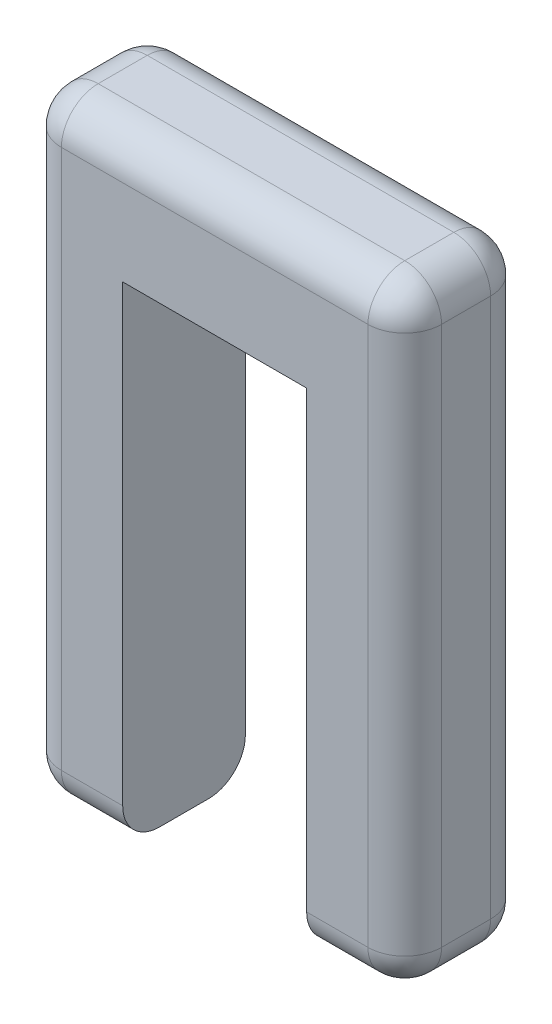
ISO-10303-21;
HEADER;
FILE_DESCRIPTION(('STEP AP214'),'2;1');
FILE_NAME('part.step','',(''),(''),'','','');
FILE_SCHEMA(('AUTOMOTIVE_DESIGN { 1 0 10303 214 1 1 1 1 }'));
ENDSEC;
DATA;
#1=APPLICATION_CONTEXT('core data for automotive mechanical design processes');
#2=APPLICATION_PROTOCOL_DEFINITION('international standard','automotive_design',2000,#1);
#3=PRODUCT_CONTEXT('',#1,'mechanical');
#4=PRODUCT('Part','Part','',(#3));
#5=PRODUCT_RELATED_PRODUCT_CATEGORY('part','',(#4));
#6=PRODUCT_DEFINITION_FORMATION('','',#4);
#7=PRODUCT_DEFINITION_CONTEXT('part definition',#1,'design');
#8=PRODUCT_DEFINITION('design','',#6,#7);
#9=PRODUCT_DEFINITION_SHAPE('','',#8);
#10=(LENGTH_UNIT() NAMED_UNIT(*) SI_UNIT(.MILLI.,.METRE.));
#11=(NAMED_UNIT(*) PLANE_ANGLE_UNIT() SI_UNIT($,.RADIAN.));
#12=(NAMED_UNIT(*) SI_UNIT($,.STERADIAN.) SOLID_ANGLE_UNIT());
#13=UNCERTAINTY_MEASURE_WITH_UNIT(LENGTH_MEASURE(1.E-05),#10,'distance_accuracy_value','');
#14=(GEOMETRIC_REPRESENTATION_CONTEXT(3) GLOBAL_UNCERTAINTY_ASSIGNED_CONTEXT((#13)) GLOBAL_UNIT_ASSIGNED_CONTEXT((#10,
#11,#12)) REPRESENTATION_CONTEXT('',''));
#15=CARTESIAN_POINT('',(0.,0.,0.));
#16=DIRECTION('',(0.,0.,1.));
#17=DIRECTION('',(1.,0.,0.));
#18=AXIS2_PLACEMENT_3D('',#15,#16,#17);
#19=CARTESIAN_POINT('',(-77.5,-200.,50.));
#20=DIRECTION('',(0.,1.,0.));
#21=DIRECTION('',(0.,0.,1.));
#22=AXIS2_PLACEMENT_3D('',#19,#20,#21);
#23=PLANE('',#22);
#24=DIRECTION('',(0.,0.,-1.));
#25=VECTOR('',#24,1.);
#26=CARTESIAN_POINT('',(-37.5,-200.,50.));
#27=LINE('',#26,#25);
#28=CARTESIAN_POINT('',(-37.5,-200.,35.));
#29=VERTEX_POINT('',#28);
#30=CARTESIAN_POINT('',(-37.5,-200.,15.));
#31=VERTEX_POINT('',#30);
#32=EDGE_CURVE('E180',#29,#31,#27,.T.);
#33=ORIENTED_EDGE('',*,*,#32,.F.);
#34=DIRECTION('',(1.,0.,0.));
#35=VECTOR('',#34,1.);
#36=CARTESIAN_POINT('',(-77.5,-200.,35.));
#37=LINE('',#36,#35);
#38=CARTESIAN_POINT('',(-62.5,-200.,35.));
#39=VERTEX_POINT('',#38);
#40=EDGE_CURVE('E251',#29,#39,#37,.F.);
#41=ORIENTED_EDGE('',*,*,#40,.T.);
#42=DIRECTION('',(0.,0.,-1.));
#43=VECTOR('',#42,1.);
#44=CARTESIAN_POINT('',(-62.5,-200.,50.));
#45=LINE('',#44,#43);
#46=CARTESIAN_POINT('',(-62.5,-200.,15.));
#47=VERTEX_POINT('',#46);
#48=EDGE_CURVE('E249',#39,#47,#45,.T.);
#49=ORIENTED_EDGE('',*,*,#48,.T.);
#50=DIRECTION('',(1.,0.,0.));
#51=VECTOR('',#50,1.);
#52=CARTESIAN_POINT('',(-77.5,-200.,15.));
#53=LINE('',#52,#51);
#54=EDGE_CURVE('E247',#47,#31,#53,.T.);
#55=ORIENTED_EDGE('',*,*,#54,.T.);
#56=EDGE_LOOP('',(#33,#41,#49,#55));
#57=FACE_BOUND('',#56,.T.);
#58=ADVANCED_FACE('F36',(#57),#23,.F.);
#59=CARTESIAN_POINT('',(-37.5,-200.,50.));
#60=DIRECTION('',(-1.,0.,0.));
#61=DIRECTION('',(0.,-1.,0.));
#62=AXIS2_PLACEMENT_3D('',#59,#60,#61);
#63=PLANE('',#62);
#64=DIRECTION('',(0.,1.,0.));
#65=VECTOR('',#64,1.);
#66=CARTESIAN_POINT('',(-37.5,-200.,50.));
#67=LINE('',#66,#65);
#68=CARTESIAN_POINT('',(-37.5,-185.,50.));
#69=VERTEX_POINT('',#68);
#70=CARTESIAN_POINT('',(-37.5,0.,50.));
#71=VERTEX_POINT('',#70);
#72=EDGE_CURVE('E160',#69,#71,#67,.T.);
#73=ORIENTED_EDGE('',*,*,#72,.F.);
#74=CARTESIAN_POINT('',(-37.5,-185.,35.));
#75=DIRECTION('',(-1.,0.,0.));
#76=DIRECTION('',(0.,-1.,0.));
#77=AXIS2_PLACEMENT_3D('',#74,#75,#76);
#78=CIRCLE('',#77,15.);
#79=EDGE_CURVE('E255',#69,#29,#78,.F.);
#80=ORIENTED_EDGE('',*,*,#79,.T.);
#81=ORIENTED_EDGE('',*,*,#32,.T.);
#82=CARTESIAN_POINT('',(-37.5,-185.,15.));
#83=DIRECTION('',(-1.,0.,0.));
#84=DIRECTION('',(0.,-1.,0.));
#85=AXIS2_PLACEMENT_3D('',#82,#83,#84);
#86=CIRCLE('',#85,15.);
#87=CARTESIAN_POINT('',(-37.5,-185.,0.));
#88=VERTEX_POINT('',#87);
#89=EDGE_CURVE('E253',#31,#88,#86,.F.);
#90=ORIENTED_EDGE('',*,*,#89,.T.);
#91=DIRECTION('',(0.,1.,0.));
#92=VECTOR('',#91,1.);
#93=CARTESIAN_POINT('',(-37.5,-200.,0.));
#94=LINE('',#93,#92);
#95=CARTESIAN_POINT('',(-37.5,0.,0.));
#96=VERTEX_POINT('',#95);
#97=EDGE_CURVE('E177',#88,#96,#94,.T.);
#98=ORIENTED_EDGE('',*,*,#97,.T.);
#99=DIRECTION('',(0.,0.,-1.));
#100=VECTOR('',#99,1.);
#101=CARTESIAN_POINT('',(-37.5,0.,50.));
#102=LINE('',#101,#100);
#103=EDGE_CURVE('E174',#71,#96,#102,.T.);
#104=ORIENTED_EDGE('',*,*,#103,.F.);
#105=EDGE_LOOP('',(#73,#80,#81,#90,#98,#104));
#106=FACE_BOUND('',#105,.T.);
#107=ADVANCED_FACE('F175',(#106),#63,.F.);
#108=CARTESIAN_POINT('',(-37.5,0.,50.));
#109=DIRECTION('',(0.,1.,0.));
#110=DIRECTION('',(0.,0.,1.));
#111=AXIS2_PLACEMENT_3D('',#108,#109,#110);
#112=PLANE('',#111);
#113=DIRECTION('',(1.,0.,0.));
#114=VECTOR('',#113,1.);
#115=CARTESIAN_POINT('',(-37.5,0.,0.));
#116=LINE('',#115,#114);
#117=CARTESIAN_POINT('',(37.5,0.,0.));
#118=VERTEX_POINT('',#117);
#119=EDGE_CURVE('E192',#96,#118,#116,.T.);
#120=ORIENTED_EDGE('',*,*,#119,.T.);
#121=DIRECTION('',(0.,0.,-1.));
#122=VECTOR('',#121,1.);
#123=CARTESIAN_POINT('',(37.5,0.,50.));
#124=LINE('',#123,#122);
#125=CARTESIAN_POINT('',(37.5,0.,50.));
#126=VERTEX_POINT('',#125);
#127=EDGE_CURVE('E181',#126,#118,#124,.T.);
#128=ORIENTED_EDGE('',*,*,#127,.F.);
#129=DIRECTION('',(1.,0.,0.));
#130=VECTOR('',#129,1.);
#131=CARTESIAN_POINT('',(-37.5,0.,50.));
#132=LINE('',#131,#130);
#133=EDGE_CURVE('E165',#71,#126,#132,.T.);
#134=ORIENTED_EDGE('',*,*,#133,.F.);
#135=ORIENTED_EDGE('',*,*,#103,.T.);
#136=EDGE_LOOP('',(#120,#128,#134,#135));
#137=FACE_BOUND('',#136,.T.);
#138=ADVANCED_FACE('F183',(#137),#112,.F.);
#139=CARTESIAN_POINT('',(37.5,0.,50.));
#140=DIRECTION('',(1.,0.,0.));
#141=DIRECTION('',(0.,1.,0.));
#142=AXIS2_PLACEMENT_3D('',#139,#140,#141);
#143=PLANE('',#142);
#144=DIRECTION('',(0.,-1.,0.));
#145=VECTOR('',#144,1.);
#146=CARTESIAN_POINT('',(37.5,0.,0.));
#147=LINE('',#146,#145);
#148=CARTESIAN_POINT('',(37.5,-185.,0.));
#149=VERTEX_POINT('',#148);
#150=EDGE_CURVE('E171',#118,#149,#147,.T.);
#151=ORIENTED_EDGE('',*,*,#150,.T.);
#152=CARTESIAN_POINT('',(37.5,-185.,15.));
#153=DIRECTION('',(1.,0.,0.));
#154=DIRECTION('',(0.,1.,0.));
#155=AXIS2_PLACEMENT_3D('',#152,#153,#154);
#156=CIRCLE('',#155,15.);
#157=CARTESIAN_POINT('',(37.5,-200.,15.));
#158=VERTEX_POINT('',#157);
#159=EDGE_CURVE('E11',#149,#158,#156,.F.);
#160=ORIENTED_EDGE('',*,*,#159,.T.);
#161=DIRECTION('',(0.,0.,-1.));
#162=VECTOR('',#161,1.);
#163=CARTESIAN_POINT('',(37.5,-200.,50.));
#164=LINE('',#163,#162);
#165=CARTESIAN_POINT('',(37.5,-200.,35.));
#166=VERTEX_POINT('',#165);
#167=EDGE_CURVE('E188',#166,#158,#164,.T.);
#168=ORIENTED_EDGE('',*,*,#167,.F.);
#169=CARTESIAN_POINT('',(37.5,-185.,35.));
#170=DIRECTION('',(1.,0.,0.));
#171=DIRECTION('',(0.,1.,0.));
#172=AXIS2_PLACEMENT_3D('',#169,#170,#171);
#173=CIRCLE('',#172,15.);
#174=CARTESIAN_POINT('',(37.5,-185.,50.));
#175=VERTEX_POINT('',#174);
#176=EDGE_CURVE('E45',#166,#175,#173,.F.);
#177=ORIENTED_EDGE('',*,*,#176,.T.);
#178=DIRECTION('',(0.,-1.,0.));
#179=VECTOR('',#178,1.);
#180=CARTESIAN_POINT('',(37.5,0.,50.));
#181=LINE('',#180,#179);
#182=EDGE_CURVE('E186',#126,#175,#181,.T.);
#183=ORIENTED_EDGE('',*,*,#182,.F.);
#184=ORIENTED_EDGE('',*,*,#127,.T.);
#185=EDGE_LOOP('',(#151,#160,#168,#177,#183,#184));
#186=FACE_BOUND('',#185,.T.);
#187=ADVANCED_FACE('F347',(#186),#143,.F.);
#188=CARTESIAN_POINT('',(37.5,-200.,50.));
#189=DIRECTION('',(0.,1.,0.));
#190=DIRECTION('',(0.,0.,1.));
#191=AXIS2_PLACEMENT_3D('',#188,#189,#190);
#192=PLANE('',#191);
#193=ORIENTED_EDGE('',*,*,#167,.T.);
#194=DIRECTION('',(1.,0.,0.));
#195=VECTOR('',#194,1.);
#196=CARTESIAN_POINT('',(37.5,-200.,15.));
#197=LINE('',#196,#195);
#198=CARTESIAN_POINT('',(62.5,-200.,15.));
#199=VERTEX_POINT('',#198);
#200=EDGE_CURVE('E58',#158,#199,#197,.T.);
#201=ORIENTED_EDGE('',*,*,#200,.T.);
#202=DIRECTION('',(0.,0.,-1.));
#203=VECTOR('',#202,1.);
#204=CARTESIAN_POINT('',(62.5,-200.,50.));
#205=LINE('',#204,#203);
#206=CARTESIAN_POINT('',(62.5,-200.,35.));
#207=VERTEX_POINT('',#206);
#208=EDGE_CURVE('E53',#199,#207,#205,.F.);
#209=ORIENTED_EDGE('',*,*,#208,.T.);
#210=DIRECTION('',(1.,0.,0.));
#211=VECTOR('',#210,1.);
#212=CARTESIAN_POINT('',(37.5,-200.,35.));
#213=LINE('',#212,#211);
#214=EDGE_CURVE('E258',#207,#166,#213,.F.);
#215=ORIENTED_EDGE('',*,*,#214,.T.);
#216=EDGE_LOOP('',(#193,#201,#209,#215));
#217=FACE_BOUND('',#216,.T.);
#218=ADVANCED_FACE('F345',(#217),#192,.F.);
#219=CARTESIAN_POINT('',(77.5,-200.,50.));
#220=DIRECTION('',(-1.,0.,0.));
#221=DIRECTION('',(0.,-1.,0.));
#222=AXIS2_PLACEMENT_3D('',#219,#220,#221);
#223=PLANE('',#222);
#224=DIRECTION('',(0.,1.,0.));
#225=VECTOR('',#224,1.);
#226=CARTESIAN_POINT('',(77.5,-200.,15.));
#227=LINE('',#226,#225);
#228=CARTESIAN_POINT('',(77.5,-185.,15.));
#229=VERTEX_POINT('',#228);
#230=CARTESIAN_POINT('',(77.5,35.,15.));
#231=VERTEX_POINT('',#230);
#232=EDGE_CURVE('E231',#229,#231,#227,.T.);
#233=ORIENTED_EDGE('',*,*,#232,.T.);
#234=DIRECTION('',(0.,0.,-1.));
#235=VECTOR('',#234,1.);
#236=CARTESIAN_POINT('',(77.5,35.,50.));
#237=LINE('',#236,#235);
#238=CARTESIAN_POINT('',(77.5,35.,35.));
#239=VERTEX_POINT('',#238);
#240=EDGE_CURVE('E235',#231,#239,#237,.F.);
#241=ORIENTED_EDGE('',*,*,#240,.T.);
#242=DIRECTION('',(0.,1.,0.));
#243=VECTOR('',#242,1.);
#244=CARTESIAN_POINT('',(77.5,-200.,35.));
#245=LINE('',#244,#243);
#246=CARTESIAN_POINT('',(77.5,-185.,35.));
#247=VERTEX_POINT('',#246);
#248=EDGE_CURVE('E233',#239,#247,#245,.F.);
#249=ORIENTED_EDGE('',*,*,#248,.T.);
#250=DIRECTION('',(0.,0.,-1.));
#251=VECTOR('',#250,1.);
#252=CARTESIAN_POINT('',(77.5,-185.,50.));
#253=LINE('',#252,#251);
#254=EDGE_CURVE('E229',#247,#229,#253,.T.);
#255=ORIENTED_EDGE('',*,*,#254,.T.);
#256=EDGE_LOOP('',(#233,#241,#249,#255));
#257=FACE_BOUND('',#256,.T.);
#258=ADVANCED_FACE('F361',(#257),#223,.F.);
#259=CARTESIAN_POINT('',(77.5,50.,50.));
#260=DIRECTION('',(0.,-1.,0.));
#261=DIRECTION('',(0.,0.,-1.));
#262=AXIS2_PLACEMENT_3D('',#259,#260,#261);
#263=PLANE('',#262);
#264=DIRECTION('',(-1.,0.,0.));
#265=VECTOR('',#264,1.);
#266=CARTESIAN_POINT('',(77.5,50.,15.));
#267=LINE('',#266,#265);
#268=CARTESIAN_POINT('',(62.5,50.,15.));
#269=VERTEX_POINT('',#268);
#270=CARTESIAN_POINT('',(-62.5,50.,15.));
#271=VERTEX_POINT('',#270);
#272=EDGE_CURVE('E213',#269,#271,#267,.T.);
#273=ORIENTED_EDGE('',*,*,#272,.T.);
#274=DIRECTION('',(0.,0.,-1.));
#275=VECTOR('',#274,1.);
#276=CARTESIAN_POINT('',(-62.5,50.,50.));
#277=LINE('',#276,#275);
#278=CARTESIAN_POINT('',(-62.5,50.,35.));
#279=VERTEX_POINT('',#278);
#280=EDGE_CURVE('E215',#271,#279,#277,.F.);
#281=ORIENTED_EDGE('',*,*,#280,.T.);
#282=DIRECTION('',(-1.,0.,0.));
#283=VECTOR('',#282,1.);
#284=CARTESIAN_POINT('',(77.5,50.,35.));
#285=LINE('',#284,#283);
#286=CARTESIAN_POINT('',(62.5,50.,35.));
#287=VERTEX_POINT('',#286);
#288=EDGE_CURVE('E209',#279,#287,#285,.F.);
#289=ORIENTED_EDGE('',*,*,#288,.T.);
#290=DIRECTION('',(0.,0.,-1.));
#291=VECTOR('',#290,1.);
#292=CARTESIAN_POINT('',(62.5,50.,50.));
#293=LINE('',#292,#291);
#294=EDGE_CURVE('E211',#287,#269,#293,.T.);
#295=ORIENTED_EDGE('',*,*,#294,.T.);
#296=EDGE_LOOP('',(#273,#281,#289,#295));
#297=FACE_BOUND('',#296,.T.);
#298=ADVANCED_FACE('F382',(#297),#263,.F.);
#299=CARTESIAN_POINT('',(-77.5,50.,50.));
#300=DIRECTION('',(1.,0.,0.));
#301=DIRECTION('',(0.,1.,0.));
#302=AXIS2_PLACEMENT_3D('',#299,#300,#301);
#303=PLANE('',#302);
#304=DIRECTION('',(0.,-1.,0.));
#305=VECTOR('',#304,1.);
#306=CARTESIAN_POINT('',(-77.5,50.,35.));
#307=LINE('',#306,#305);
#308=CARTESIAN_POINT('',(-77.5,-185.,35.));
#309=VERTEX_POINT('',#308);
#310=CARTESIAN_POINT('',(-77.5,35.,35.));
#311=VERTEX_POINT('',#310);
#312=EDGE_CURVE('E204',#309,#311,#307,.F.);
#313=ORIENTED_EDGE('',*,*,#312,.T.);
#314=DIRECTION('',(0.,0.,-1.));
#315=VECTOR('',#314,1.);
#316=CARTESIAN_POINT('',(-77.5,35.,50.));
#317=LINE('',#316,#315);
#318=CARTESIAN_POINT('',(-77.5,35.,15.));
#319=VERTEX_POINT('',#318);
#320=EDGE_CURVE('E206',#311,#319,#317,.T.);
#321=ORIENTED_EDGE('',*,*,#320,.T.);
#322=DIRECTION('',(0.,-1.,0.));
#323=VECTOR('',#322,1.);
#324=CARTESIAN_POINT('',(-77.5,50.,15.));
#325=LINE('',#324,#323);
#326=CARTESIAN_POINT('',(-77.5,-185.,15.));
#327=VERTEX_POINT('',#326);
#328=EDGE_CURVE('E202',#319,#327,#325,.T.);
#329=ORIENTED_EDGE('',*,*,#328,.T.);
#330=DIRECTION('',(0.,0.,-1.));
#331=VECTOR('',#330,1.);
#332=CARTESIAN_POINT('',(-77.5,-185.,50.));
#333=LINE('',#332,#331);
#334=EDGE_CURVE('E200',#327,#309,#333,.F.);
#335=ORIENTED_EDGE('',*,*,#334,.T.);
#336=EDGE_LOOP('',(#313,#321,#329,#335));
#337=FACE_BOUND('',#336,.T.);
#338=ADVANCED_FACE('F432',(#337),#303,.F.);
#339=CARTESIAN_POINT('',(0.,0.,50.));
#340=DIRECTION('',(0.,0.,1.));
#341=DIRECTION('',(1.,0.,0.));
#342=AXIS2_PLACEMENT_3D('',#339,#340,#341);
#343=PLANE('',#342);
#344=DIRECTION('',(0.,-1.,0.));
#345=VECTOR('',#344,1.);
#346=CARTESIAN_POINT('',(-62.5,-200.,50.));
#347=LINE('',#346,#345);
#348=CARTESIAN_POINT('',(-62.5,35.,50.));
#349=VERTEX_POINT('',#348);
#350=CARTESIAN_POINT('',(-62.5,-185.,50.));
#351=VERTEX_POINT('',#350);
#352=EDGE_CURVE('E244',#349,#351,#347,.T.);
#353=ORIENTED_EDGE('',*,*,#352,.T.);
#354=DIRECTION('',(1.,0.,0.));
#355=VECTOR('',#354,1.);
#356=CARTESIAN_POINT('',(-37.5,-185.,50.));
#357=LINE('',#356,#355);
#358=EDGE_CURVE('E168',#351,#69,#357,.T.);
#359=ORIENTED_EDGE('',*,*,#358,.T.);
#360=ORIENTED_EDGE('',*,*,#72,.T.);
#361=ORIENTED_EDGE('',*,*,#133,.T.);
#362=ORIENTED_EDGE('',*,*,#182,.T.);
#363=DIRECTION('',(1.,0.,0.));
#364=VECTOR('',#363,1.);
#365=CARTESIAN_POINT('',(77.5,-185.,50.));
#366=LINE('',#365,#364);
#367=CARTESIAN_POINT('',(62.5,-185.,50.));
#368=VERTEX_POINT('',#367);
#369=EDGE_CURVE('E238',#175,#368,#366,.T.);
#370=ORIENTED_EDGE('',*,*,#369,.T.);
#371=DIRECTION('',(0.,1.,0.));
#372=VECTOR('',#371,1.);
#373=CARTESIAN_POINT('',(62.5,50.,50.));
#374=LINE('',#373,#372);
#375=CARTESIAN_POINT('',(62.5,35.,50.));
#376=VERTEX_POINT('',#375);
#377=EDGE_CURVE('E240',#368,#376,#374,.T.);
#378=ORIENTED_EDGE('',*,*,#377,.T.);
#379=DIRECTION('',(-1.,0.,0.));
#380=VECTOR('',#379,1.);
#381=CARTESIAN_POINT('',(-77.5,35.,50.));
#382=LINE('',#381,#380);
#383=EDGE_CURVE('E242',#376,#349,#382,.T.);
#384=ORIENTED_EDGE('',*,*,#383,.T.);
#385=EDGE_LOOP('',(#353,#359,#360,#361,#362,#370,#378,#384));
#386=FACE_BOUND('',#385,.T.);
#387=ADVANCED_FACE('F162',(#386),#343,.T.);
#388=CARTESIAN_POINT('',(0.,0.,0.));
#389=DIRECTION('',(0.,0.,1.));
#390=DIRECTION('',(1.,0.,0.));
#391=AXIS2_PLACEMENT_3D('',#388,#389,#390);
#392=PLANE('',#391);
#393=ORIENTED_EDGE('',*,*,#97,.F.);
#394=DIRECTION('',(1.,0.,0.));
#395=VECTOR('',#394,1.);
#396=CARTESIAN_POINT('',(0.,-185.,0.));
#397=LINE('',#396,#395);
#398=CARTESIAN_POINT('',(-62.5,-185.,0.));
#399=VERTEX_POINT('',#398);
#400=EDGE_CURVE('E227',#88,#399,#397,.F.);
#401=ORIENTED_EDGE('',*,*,#400,.T.);
#402=DIRECTION('',(0.,-1.,0.));
#403=VECTOR('',#402,1.);
#404=CARTESIAN_POINT('',(-62.5,0.,0.));
#405=LINE('',#404,#403);
#406=CARTESIAN_POINT('',(-62.5,35.,0.));
#407=VERTEX_POINT('',#406);
#408=EDGE_CURVE('E225',#399,#407,#405,.F.);
#409=ORIENTED_EDGE('',*,*,#408,.T.);
#410=DIRECTION('',(-1.,0.,0.));
#411=VECTOR('',#410,1.);
#412=CARTESIAN_POINT('',(0.,35.,0.));
#413=LINE('',#412,#411);
#414=CARTESIAN_POINT('',(62.5,35.,0.));
#415=VERTEX_POINT('',#414);
#416=EDGE_CURVE('E222',#407,#415,#413,.F.);
#417=ORIENTED_EDGE('',*,*,#416,.T.);
#418=DIRECTION('',(0.,1.,0.));
#419=VECTOR('',#418,1.);
#420=CARTESIAN_POINT('',(62.5,0.,0.));
#421=LINE('',#420,#419);
#422=CARTESIAN_POINT('',(62.5,-185.,0.));
#423=VERTEX_POINT('',#422);
#424=EDGE_CURVE('E220',#415,#423,#421,.F.);
#425=ORIENTED_EDGE('',*,*,#424,.T.);
#426=DIRECTION('',(1.,0.,0.));
#427=VECTOR('',#426,1.);
#428=CARTESIAN_POINT('',(0.,-185.,0.));
#429=LINE('',#428,#427);
#430=EDGE_CURVE('E218',#423,#149,#429,.F.);
#431=ORIENTED_EDGE('',*,*,#430,.T.);
#432=ORIENTED_EDGE('',*,*,#150,.F.);
#433=ORIENTED_EDGE('',*,*,#119,.F.);
#434=EDGE_LOOP('',(#393,#401,#409,#417,#425,#431,#432,#433));
#435=FACE_BOUND('',#434,.T.);
#436=ADVANCED_FACE('F420',(#435),#392,.F.);
#437=CARTESIAN_POINT('',(0.,-185.,35.));
#438=DIRECTION('',(-1.,0.,0.));
#439=DIRECTION('',(0.,0.,1.));
#440=AXIS2_PLACEMENT_3D('',#437,#438,#439);
#441=CYLINDRICAL_SURFACE('',#440,15.);
#442=ORIENTED_EDGE('',*,*,#176,.F.);
#443=ORIENTED_EDGE('',*,*,#214,.F.);
#444=CARTESIAN_POINT('',(62.5,-185.,35.));
#445=DIRECTION('',(1.,0.,0.));
#446=DIRECTION('',(0.,0.,-1.));
#447=AXIS2_PLACEMENT_3D('',#444,#445,#446);
#448=CIRCLE('',#447,15.);
#449=EDGE_CURVE('E323',#368,#207,#448,.T.);
#450=ORIENTED_EDGE('',*,*,#449,.F.);
#451=ORIENTED_EDGE('',*,*,#369,.F.);
#452=EDGE_LOOP('',(#442,#443,#450,#451));
#453=FACE_BOUND('',#452,.T.);
#454=ADVANCED_FACE('F38',(#453),#441,.T.);
#455=CARTESIAN_POINT('',(37.5,-185.,15.));
#456=DIRECTION('',(1.,0.,0.));
#457=DIRECTION('',(0.,0.,-1.));
#458=AXIS2_PLACEMENT_3D('',#455,#456,#457);
#459=CYLINDRICAL_SURFACE('',#458,15.);
#460=ORIENTED_EDGE('',*,*,#159,.F.);
#461=ORIENTED_EDGE('',*,*,#430,.F.);
#462=CARTESIAN_POINT('',(62.5,-185.,15.));
#463=DIRECTION('',(1.,0.,0.));
#464=DIRECTION('',(0.,0.,-1.));
#465=AXIS2_PLACEMENT_3D('',#462,#463,#464);
#466=CIRCLE('',#465,15.);
#467=EDGE_CURVE('E321',#199,#423,#466,.T.);
#468=ORIENTED_EDGE('',*,*,#467,.F.);
#469=ORIENTED_EDGE('',*,*,#200,.F.);
#470=EDGE_LOOP('',(#460,#461,#468,#469));
#471=FACE_BOUND('',#470,.T.);
#472=ADVANCED_FACE('F352',(#471),#459,.T.);
#473=CARTESIAN_POINT('',(62.5,-185.,50.));
#474=DIRECTION('',(0.,0.,-1.));
#475=DIRECTION('',(-1.,0.,0.));
#476=AXIS2_PLACEMENT_3D('',#473,#474,#475);
#477=CYLINDRICAL_SURFACE('',#476,15.);
#478=CARTESIAN_POINT('',(62.5,-185.,35.));
#479=DIRECTION('',(0.,0.,1.));
#480=DIRECTION('',(1.,0.,0.));
#481=AXIS2_PLACEMENT_3D('',#478,#479,#480);
#482=CIRCLE('',#481,15.);
#483=EDGE_CURVE('E40',#207,#247,#482,.T.);
#484=ORIENTED_EDGE('',*,*,#483,.F.);
#485=ORIENTED_EDGE('',*,*,#208,.F.);
#486=CARTESIAN_POINT('',(62.5,-185.,15.));
#487=DIRECTION('',(0.,0.,-1.));
#488=DIRECTION('',(-1.,0.,0.));
#489=AXIS2_PLACEMENT_3D('',#486,#487,#488);
#490=CIRCLE('',#489,15.);
#491=EDGE_CURVE('E318',#229,#199,#490,.T.);
#492=ORIENTED_EDGE('',*,*,#491,.F.);
#493=ORIENTED_EDGE('',*,*,#254,.F.);
#494=EDGE_LOOP('',(#484,#485,#492,#493));
#495=FACE_BOUND('',#494,.T.);
#496=ADVANCED_FACE('F359',(#495),#477,.T.);
#497=CARTESIAN_POINT('',(62.5,-185.,35.));
#498=DIRECTION('',(0.,-1.,0.));
#499=DIRECTION('',(0.,0.,-1.));
#500=AXIS2_PLACEMENT_3D('',#497,#498,#499);
#501=SPHERICAL_SURFACE('',#500,15.);
#502=ORIENTED_EDGE('',*,*,#449,.T.);
#503=ORIENTED_EDGE('',*,*,#483,.T.);
#504=CARTESIAN_POINT('',(62.5,-185.,35.));
#505=DIRECTION('',(0.,-1.,0.));
#506=DIRECTION('',(0.,0.,-1.));
#507=AXIS2_PLACEMENT_3D('',#504,#505,#506);
#508=CIRCLE('',#507,15.);
#509=EDGE_CURVE('E315',#368,#247,#508,.F.);
#510=ORIENTED_EDGE('',*,*,#509,.F.);
#511=EDGE_LOOP('',(#502,#503,#510));
#512=FACE_BOUND('',#511,.T.);
#513=ADVANCED_FACE('F330',(#512),#501,.T.);
#514=CARTESIAN_POINT('',(62.5,-185.,15.));
#515=DIRECTION('',(0.,-1.,0.));
#516=DIRECTION('',(0.,0.,-1.));
#517=AXIS2_PLACEMENT_3D('',#514,#515,#516);
#518=SPHERICAL_SURFACE('',#517,15.);
#519=ORIENTED_EDGE('',*,*,#491,.T.);
#520=ORIENTED_EDGE('',*,*,#467,.T.);
#521=CARTESIAN_POINT('',(62.5,-185.,15.));
#522=DIRECTION('',(0.,-1.,0.));
#523=DIRECTION('',(0.,0.,-1.));
#524=AXIS2_PLACEMENT_3D('',#521,#522,#523);
#525=CIRCLE('',#524,15.);
#526=EDGE_CURVE('E312',#229,#423,#525,.F.);
#527=ORIENTED_EDGE('',*,*,#526,.F.);
#528=EDGE_LOOP('',(#519,#520,#527));
#529=FACE_BOUND('',#528,.T.);
#530=ADVANCED_FACE('F357',(#529),#518,.T.);
#531=CARTESIAN_POINT('',(62.5,0.,35.));
#532=DIRECTION('',(0.,-1.,0.));
#533=DIRECTION('',(1.,0.,0.));
#534=AXIS2_PLACEMENT_3D('',#531,#532,#533);
#535=CYLINDRICAL_SURFACE('',#534,15.);
#536=ORIENTED_EDGE('',*,*,#509,.T.);
#537=ORIENTED_EDGE('',*,*,#248,.F.);
#538=CARTESIAN_POINT('',(62.5,35.,35.));
#539=DIRECTION('',(0.,1.,0.));
#540=DIRECTION('',(0.,0.,1.));
#541=AXIS2_PLACEMENT_3D('',#538,#539,#540);
#542=CIRCLE('',#541,15.);
#543=EDGE_CURVE('E307',#376,#239,#542,.T.);
#544=ORIENTED_EDGE('',*,*,#543,.F.);
#545=ORIENTED_EDGE('',*,*,#377,.F.);
#546=EDGE_LOOP('',(#536,#537,#544,#545));
#547=FACE_BOUND('',#546,.T.);
#548=ADVANCED_FACE('F336',(#547),#535,.T.);
#549=CARTESIAN_POINT('',(0.,-185.,35.));
#550=DIRECTION('',(-1.,0.,0.));
#551=DIRECTION('',(0.,0.,1.));
#552=AXIS2_PLACEMENT_3D('',#549,#550,#551);
#553=CYLINDRICAL_SURFACE('',#552,15.);
#554=ORIENTED_EDGE('',*,*,#79,.F.);
#555=ORIENTED_EDGE('',*,*,#358,.F.);
#556=CARTESIAN_POINT('',(-62.5,-185.,35.));
#557=DIRECTION('',(-1.,0.,0.));
#558=DIRECTION('',(0.,0.,1.));
#559=AXIS2_PLACEMENT_3D('',#556,#557,#558);
#560=CIRCLE('',#559,15.);
#561=EDGE_CURVE('E304',#39,#351,#560,.T.);
#562=ORIENTED_EDGE('',*,*,#561,.F.);
#563=ORIENTED_EDGE('',*,*,#40,.F.);
#564=EDGE_LOOP('',(#554,#555,#562,#563));
#565=FACE_BOUND('',#564,.T.);
#566=ADVANCED_FACE('F400',(#565),#553,.T.);
#567=CARTESIAN_POINT('',(-62.5,-185.,50.));
#568=DIRECTION('',(0.,0.,-1.));
#569=DIRECTION('',(-1.,0.,0.));
#570=AXIS2_PLACEMENT_3D('',#567,#568,#569);
#571=CYLINDRICAL_SURFACE('',#570,15.);
#572=CARTESIAN_POINT('',(-62.5,-185.,15.));
#573=DIRECTION('',(0.,0.,-1.));
#574=DIRECTION('',(-1.,0.,0.));
#575=AXIS2_PLACEMENT_3D('',#572,#573,#574);
#576=CIRCLE('',#575,15.);
#577=EDGE_CURVE('E298',#47,#327,#576,.T.);
#578=ORIENTED_EDGE('',*,*,#577,.F.);
#579=ORIENTED_EDGE('',*,*,#48,.F.);
#580=CARTESIAN_POINT('',(-62.5,-185.,35.));
#581=DIRECTION('',(0.,0.,1.));
#582=DIRECTION('',(1.,0.,0.));
#583=AXIS2_PLACEMENT_3D('',#580,#581,#582);
#584=CIRCLE('',#583,15.);
#585=EDGE_CURVE('E301',#309,#39,#584,.T.);
#586=ORIENTED_EDGE('',*,*,#585,.F.);
#587=ORIENTED_EDGE('',*,*,#334,.F.);
#588=EDGE_LOOP('',(#578,#579,#586,#587));
#589=FACE_BOUND('',#588,.T.);
#590=ADVANCED_FACE('F409',(#589),#571,.T.);
#591=CARTESIAN_POINT('',(-77.5,-185.,15.));
#592=DIRECTION('',(1.,0.,0.));
#593=DIRECTION('',(0.,0.,-1.));
#594=AXIS2_PLACEMENT_3D('',#591,#592,#593);
#595=CYLINDRICAL_SURFACE('',#594,15.);
#596=ORIENTED_EDGE('',*,*,#89,.F.);
#597=ORIENTED_EDGE('',*,*,#54,.F.);
#598=CARTESIAN_POINT('',(-62.5,-185.,15.));
#599=DIRECTION('',(-1.,0.,0.));
#600=DIRECTION('',(0.,0.,1.));
#601=AXIS2_PLACEMENT_3D('',#598,#599,#600);
#602=CIRCLE('',#601,15.);
#603=EDGE_CURVE('E295',#399,#47,#602,.T.);
#604=ORIENTED_EDGE('',*,*,#603,.F.);
#605=ORIENTED_EDGE('',*,*,#400,.F.);
#606=EDGE_LOOP('',(#596,#597,#604,#605));
#607=FACE_BOUND('',#606,.T.);
#608=ADVANCED_FACE('F416',(#607),#595,.T.);
#609=CARTESIAN_POINT('',(62.5,-200.,15.));
#610=DIRECTION('',(0.,1.,0.));
#611=DIRECTION('',(-1.,0.,0.));
#612=AXIS2_PLACEMENT_3D('',#609,#610,#611);
#613=CYLINDRICAL_SURFACE('',#612,15.);
#614=ORIENTED_EDGE('',*,*,#526,.T.);
#615=ORIENTED_EDGE('',*,*,#424,.F.);
#616=CARTESIAN_POINT('',(62.5,35.,15.));
#617=DIRECTION('',(0.,1.,0.));
#618=DIRECTION('',(0.,0.,1.));
#619=AXIS2_PLACEMENT_3D('',#616,#617,#618);
#620=CIRCLE('',#619,15.);
#621=EDGE_CURVE('E292',#231,#415,#620,.T.);
#622=ORIENTED_EDGE('',*,*,#621,.F.);
#623=ORIENTED_EDGE('',*,*,#232,.F.);
#624=EDGE_LOOP('',(#614,#615,#622,#623));
#625=FACE_BOUND('',#624,.T.);
#626=ADVANCED_FACE('F372',(#625),#613,.T.);
#627=CARTESIAN_POINT('',(62.5,35.,50.));
#628=DIRECTION('',(0.,0.,-1.));
#629=DIRECTION('',(-1.,0.,0.));
#630=AXIS2_PLACEMENT_3D('',#627,#628,#629);
#631=CYLINDRICAL_SURFACE('',#630,15.);
#632=CARTESIAN_POINT('',(62.5,35.,35.));
#633=DIRECTION('',(0.,0.,1.));
#634=DIRECTION('',(1.,0.,0.));
#635=AXIS2_PLACEMENT_3D('',#632,#633,#634);
#636=CIRCLE('',#635,15.);
#637=EDGE_CURVE('E309',#239,#287,#636,.T.);
#638=ORIENTED_EDGE('',*,*,#637,.F.);
#639=ORIENTED_EDGE('',*,*,#240,.F.);
#640=CARTESIAN_POINT('',(62.5,35.,15.));
#641=DIRECTION('',(0.,0.,-1.));
#642=DIRECTION('',(-1.,0.,0.));
#643=AXIS2_PLACEMENT_3D('',#640,#641,#642);
#644=CIRCLE('',#643,15.);
#645=EDGE_CURVE('E289',#269,#231,#644,.T.);
#646=ORIENTED_EDGE('',*,*,#645,.F.);
#647=ORIENTED_EDGE('',*,*,#294,.F.);
#648=EDGE_LOOP('',(#638,#639,#646,#647));
#649=FACE_BOUND('',#648,.T.);
#650=ADVANCED_FACE('F367',(#649),#631,.T.);
#651=CARTESIAN_POINT('',(62.5,35.,35.));
#652=DIRECTION('',(1.,0.,0.));
#653=DIRECTION('',(0.,0.,-1.));
#654=AXIS2_PLACEMENT_3D('',#651,#652,#653);
#655=SPHERICAL_SURFACE('',#654,15.);
#656=ORIENTED_EDGE('',*,*,#543,.T.);
#657=ORIENTED_EDGE('',*,*,#637,.T.);
#658=CARTESIAN_POINT('',(62.5,35.,35.));
#659=DIRECTION('',(1.,0.,0.));
#660=DIRECTION('',(0.,0.,-1.));
#661=AXIS2_PLACEMENT_3D('',#658,#659,#660);
#662=CIRCLE('',#661,15.);
#663=EDGE_CURVE('E286',#376,#287,#662,.F.);
#664=ORIENTED_EDGE('',*,*,#663,.F.);
#665=EDGE_LOOP('',(#656,#657,#664));
#666=FACE_BOUND('',#665,.T.);
#667=ADVANCED_FACE('F385',(#666),#655,.T.);
#668=CARTESIAN_POINT('',(-62.5,-185.,35.));
#669=DIRECTION('',(0.,-1.,0.));
#670=DIRECTION('',(0.,0.,-1.));
#671=AXIS2_PLACEMENT_3D('',#668,#669,#670);
#672=SPHERICAL_SURFACE('',#671,15.);
#673=ORIENTED_EDGE('',*,*,#585,.T.);
#674=ORIENTED_EDGE('',*,*,#561,.T.);
#675=CARTESIAN_POINT('',(-62.5,-185.,35.));
#676=DIRECTION('',(0.,-1.,0.));
#677=DIRECTION('',(0.,0.,-1.));
#678=AXIS2_PLACEMENT_3D('',#675,#676,#677);
#679=CIRCLE('',#678,15.);
#680=EDGE_CURVE('E283',#309,#351,#679,.F.);
#681=ORIENTED_EDGE('',*,*,#680,.F.);
#682=EDGE_LOOP('',(#673,#674,#681));
#683=FACE_BOUND('',#682,.T.);
#684=ADVANCED_FACE('F403',(#683),#672,.T.);
#685=CARTESIAN_POINT('',(-62.5,-185.,15.));
#686=DIRECTION('',(0.,-1.,0.));
#687=DIRECTION('',(0.,0.,-1.));
#688=AXIS2_PLACEMENT_3D('',#685,#686,#687);
#689=SPHERICAL_SURFACE('',#688,15.);
#690=ORIENTED_EDGE('',*,*,#603,.T.);
#691=ORIENTED_EDGE('',*,*,#577,.T.);
#692=CARTESIAN_POINT('',(-62.5,-185.,15.));
#693=DIRECTION('',(0.,-1.,0.));
#694=DIRECTION('',(0.,0.,-1.));
#695=AXIS2_PLACEMENT_3D('',#692,#693,#694);
#696=CIRCLE('',#695,15.);
#697=EDGE_CURVE('E280',#399,#327,#696,.F.);
#698=ORIENTED_EDGE('',*,*,#697,.F.);
#699=EDGE_LOOP('',(#690,#691,#698));
#700=FACE_BOUND('',#699,.T.);
#701=ADVANCED_FACE('F466',(#700),#689,.T.);
#702=CARTESIAN_POINT('',(62.5,35.,15.));
#703=DIRECTION('',(1.,0.,0.));
#704=DIRECTION('',(0.,0.,-1.));
#705=AXIS2_PLACEMENT_3D('',#702,#703,#704);
#706=SPHERICAL_SURFACE('',#705,15.);
#707=ORIENTED_EDGE('',*,*,#645,.T.);
#708=ORIENTED_EDGE('',*,*,#621,.T.);
#709=CARTESIAN_POINT('',(62.5,35.,15.));
#710=DIRECTION('',(1.,0.,0.));
#711=DIRECTION('',(0.,0.,-1.));
#712=AXIS2_PLACEMENT_3D('',#709,#710,#711);
#713=CIRCLE('',#712,15.);
#714=EDGE_CURVE('E278',#269,#415,#713,.F.);
#715=ORIENTED_EDGE('',*,*,#714,.F.);
#716=EDGE_LOOP('',(#707,#708,#715));
#717=FACE_BOUND('',#716,.T.);
#718=ADVANCED_FACE('F374',(#717),#706,.T.);
#719=CARTESIAN_POINT('',(0.,35.,35.));
#720=DIRECTION('',(1.,0.,0.));
#721=DIRECTION('',(0.,0.,-1.));
#722=AXIS2_PLACEMENT_3D('',#719,#720,#721);
#723=CYLINDRICAL_SURFACE('',#722,15.);
#724=ORIENTED_EDGE('',*,*,#663,.T.);
#725=ORIENTED_EDGE('',*,*,#288,.F.);
#726=CARTESIAN_POINT('',(-62.5,35.,35.));
#727=DIRECTION('',(-1.,0.,0.));
#728=DIRECTION('',(0.,0.,1.));
#729=AXIS2_PLACEMENT_3D('',#726,#727,#728);
#730=CIRCLE('',#729,15.);
#731=EDGE_CURVE('E275',#349,#279,#730,.T.);
#732=ORIENTED_EDGE('',*,*,#731,.F.);
#733=ORIENTED_EDGE('',*,*,#383,.F.);
#734=EDGE_LOOP('',(#724,#725,#732,#733));
#735=FACE_BOUND('',#734,.T.);
#736=ADVANCED_FACE('F387',(#735),#723,.T.);
#737=CARTESIAN_POINT('',(-62.5,0.,35.));
#738=DIRECTION('',(0.,1.,0.));
#739=DIRECTION('',(-1.,0.,0.));
#740=AXIS2_PLACEMENT_3D('',#737,#738,#739);
#741=CYLINDRICAL_SURFACE('',#740,15.);
#742=ORIENTED_EDGE('',*,*,#680,.T.);
#743=ORIENTED_EDGE('',*,*,#352,.F.);
#744=CARTESIAN_POINT('',(-62.5,35.,35.));
#745=DIRECTION('',(0.,1.,0.));
#746=DIRECTION('',(0.,0.,1.));
#747=AXIS2_PLACEMENT_3D('',#744,#745,#746);
#748=CIRCLE('',#747,15.);
#749=EDGE_CURVE('E272',#311,#349,#748,.T.);
#750=ORIENTED_EDGE('',*,*,#749,.F.);
#751=ORIENTED_EDGE('',*,*,#312,.F.);
#752=EDGE_LOOP('',(#742,#743,#750,#751));
#753=FACE_BOUND('',#752,.T.);
#754=ADVANCED_FACE('F396',(#753),#741,.T.);
#755=CARTESIAN_POINT('',(-62.5,50.,15.));
#756=DIRECTION('',(0.,-1.,0.));
#757=DIRECTION('',(1.,0.,0.));
#758=AXIS2_PLACEMENT_3D('',#755,#756,#757);
#759=CYLINDRICAL_SURFACE('',#758,15.);
#760=ORIENTED_EDGE('',*,*,#697,.T.);
#761=ORIENTED_EDGE('',*,*,#328,.F.);
#762=CARTESIAN_POINT('',(-62.5,35.,15.));
#763=DIRECTION('',(0.,1.,0.));
#764=DIRECTION('',(0.,0.,1.));
#765=AXIS2_PLACEMENT_3D('',#762,#763,#764);
#766=CIRCLE('',#765,15.);
#767=EDGE_CURVE('E269',#407,#319,#766,.T.);
#768=ORIENTED_EDGE('',*,*,#767,.F.);
#769=ORIENTED_EDGE('',*,*,#408,.F.);
#770=EDGE_LOOP('',(#760,#761,#768,#769));
#771=FACE_BOUND('',#770,.T.);
#772=ADVANCED_FACE('F425',(#771),#759,.T.);
#773=CARTESIAN_POINT('',(77.5,35.,15.));
#774=DIRECTION('',(-1.,0.,0.));
#775=DIRECTION('',(0.,0.,1.));
#776=AXIS2_PLACEMENT_3D('',#773,#774,#775);
#777=CYLINDRICAL_SURFACE('',#776,15.);
#778=ORIENTED_EDGE('',*,*,#714,.T.);
#779=ORIENTED_EDGE('',*,*,#416,.F.);
#780=CARTESIAN_POINT('',(-62.5,35.,15.));
#781=DIRECTION('',(-1.,0.,0.));
#782=DIRECTION('',(0.,0.,1.));
#783=AXIS2_PLACEMENT_3D('',#780,#781,#782);
#784=CIRCLE('',#783,15.);
#785=EDGE_CURVE('E266',#271,#407,#784,.T.);
#786=ORIENTED_EDGE('',*,*,#785,.F.);
#787=ORIENTED_EDGE('',*,*,#272,.F.);
#788=EDGE_LOOP('',(#778,#779,#786,#787));
#789=FACE_BOUND('',#788,.T.);
#790=ADVANCED_FACE('F379',(#789),#777,.T.);
#791=CARTESIAN_POINT('',(-62.5,35.,35.));
#792=DIRECTION('',(0.,0.,1.));
#793=DIRECTION('',(1.,0.,0.));
#794=AXIS2_PLACEMENT_3D('',#791,#792,#793);
#795=SPHERICAL_SURFACE('',#794,15.);
#796=ORIENTED_EDGE('',*,*,#749,.T.);
#797=ORIENTED_EDGE('',*,*,#731,.T.);
#798=CARTESIAN_POINT('',(-62.5,35.,35.));
#799=DIRECTION('',(0.,0.,1.));
#800=DIRECTION('',(1.,0.,0.));
#801=AXIS2_PLACEMENT_3D('',#798,#799,#800);
#802=CIRCLE('',#801,15.);
#803=EDGE_CURVE('E264',#311,#279,#802,.F.);
#804=ORIENTED_EDGE('',*,*,#803,.F.);
#805=EDGE_LOOP('',(#796,#797,#804));
#806=FACE_BOUND('',#805,.T.);
#807=ADVANCED_FACE('F392',(#806),#795,.T.);
#808=CARTESIAN_POINT('',(-62.5,35.,15.));
#809=DIRECTION('',(0.,0.,-1.));
#810=DIRECTION('',(-1.,0.,0.));
#811=AXIS2_PLACEMENT_3D('',#808,#809,#810);
#812=SPHERICAL_SURFACE('',#811,15.);
#813=ORIENTED_EDGE('',*,*,#785,.T.);
#814=ORIENTED_EDGE('',*,*,#767,.T.);
#815=CARTESIAN_POINT('',(-62.5,35.,15.));
#816=DIRECTION('',(0.,0.,-1.));
#817=DIRECTION('',(-1.,0.,0.));
#818=AXIS2_PLACEMENT_3D('',#815,#816,#817);
#819=CIRCLE('',#818,15.);
#820=EDGE_CURVE('E262',#271,#319,#819,.F.);
#821=ORIENTED_EDGE('',*,*,#820,.F.);
#822=EDGE_LOOP('',(#813,#814,#821));
#823=FACE_BOUND('',#822,.T.);
#824=ADVANCED_FACE('F428',(#823),#812,.T.);
#825=CARTESIAN_POINT('',(-62.5,35.,50.));
#826=DIRECTION('',(0.,0.,-1.));
#827=DIRECTION('',(-1.,0.,0.));
#828=AXIS2_PLACEMENT_3D('',#825,#826,#827);
#829=CYLINDRICAL_SURFACE('',#828,15.);
#830=ORIENTED_EDGE('',*,*,#803,.T.);
#831=ORIENTED_EDGE('',*,*,#280,.F.);
#832=ORIENTED_EDGE('',*,*,#820,.T.);
#833=ORIENTED_EDGE('',*,*,#320,.F.);
#834=EDGE_LOOP('',(#830,#831,#832,#833));
#835=FACE_BOUND('',#834,.T.);
#836=ADVANCED_FACE('F430',(#835),#829,.T.);
#837=CLOSED_SHELL('',(#58,#107,#138,#187,#218,#258,#298,#338,#387,#436,#454,#472,#496,#513,#530,
#548,#566,#590,#608,#626,#650,#667,#684,#701,#718,#736,#754,#772,#790,#807,#824,#836));
#838=MANIFOLD_SOLID_BREP('B2',#837);
#839=ADVANCED_BREP_SHAPE_REPRESENTATION('',(#18,#838),#14);
#840=SHAPE_DEFINITION_REPRESENTATION(#9,#839);
ENDSEC;
END-ISO-10303-21;
